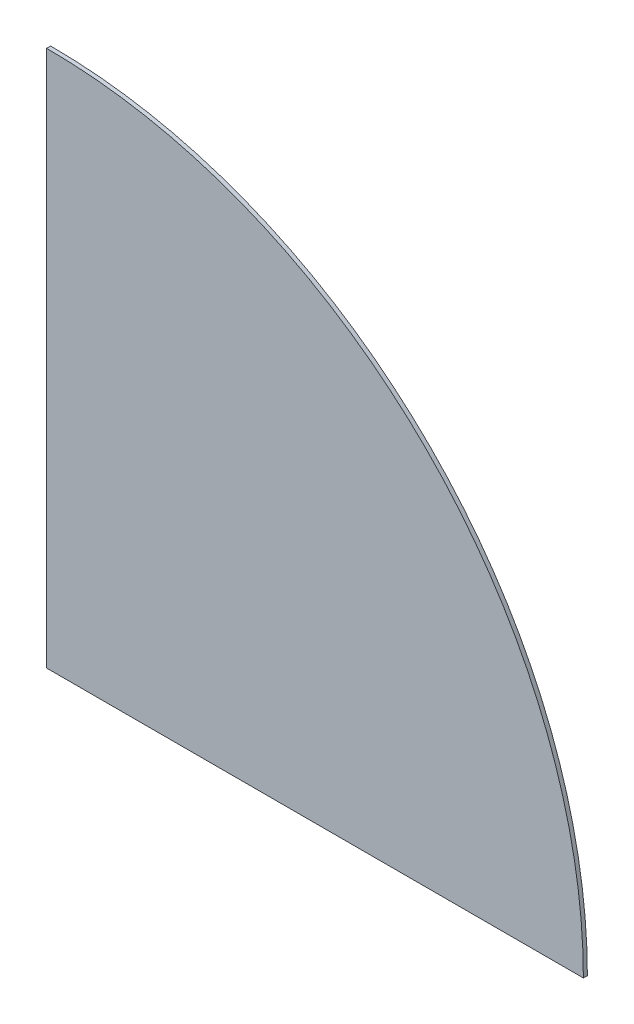
ISO-10303-21;
HEADER;
FILE_DESCRIPTION(('STEP AP214'),'2;1');
FILE_NAME('part.step','',(''),(''),'','','');
FILE_SCHEMA(('AUTOMOTIVE_DESIGN { 1 0 10303 214 1 1 1 1 }'));
ENDSEC;
DATA;
#1=APPLICATION_CONTEXT('core data for automotive mechanical design processes');
#2=APPLICATION_PROTOCOL_DEFINITION('international standard','automotive_design',2000,#1);
#3=PRODUCT_CONTEXT('',#1,'mechanical');
#4=PRODUCT('Part','Part','',(#3));
#5=PRODUCT_RELATED_PRODUCT_CATEGORY('part','',(#4));
#6=PRODUCT_DEFINITION_FORMATION('','',#4);
#7=PRODUCT_DEFINITION_CONTEXT('part definition',#1,'design');
#8=PRODUCT_DEFINITION('design','',#6,#7);
#9=PRODUCT_DEFINITION_SHAPE('','',#8);
#10=(LENGTH_UNIT() NAMED_UNIT(*) SI_UNIT(.MILLI.,.METRE.));
#11=(NAMED_UNIT(*) PLANE_ANGLE_UNIT() SI_UNIT($,.RADIAN.));
#12=(NAMED_UNIT(*) SI_UNIT($,.STERADIAN.) SOLID_ANGLE_UNIT());
#13=UNCERTAINTY_MEASURE_WITH_UNIT(LENGTH_MEASURE(1.E-05),#10,'distance_accuracy_value','');
#14=(GEOMETRIC_REPRESENTATION_CONTEXT(3) GLOBAL_UNCERTAINTY_ASSIGNED_CONTEXT((#13)) GLOBAL_UNIT_ASSIGNED_CONTEXT((#10,
#11,#12)) REPRESENTATION_CONTEXT('',''));
#15=CARTESIAN_POINT('',(0.,0.,0.));
#16=DIRECTION('',(0.,0.,1.));
#17=DIRECTION('',(1.,0.,0.));
#18=AXIS2_PLACEMENT_3D('',#15,#16,#17);
#19=CARTESIAN_POINT('',(-165.408360024912,-334.,1.));
#20=DIRECTION('',(-1.,0.,0.));
#21=DIRECTION('',(0.,0.,1.));
#22=AXIS2_PLACEMENT_3D('',#19,#20,#21);
#23=PLANE('',#22);
#24=DIRECTION('',(0.,1.,0.));
#25=VECTOR('',#24,1.);
#26=CARTESIAN_POINT('',(-165.408360024912,-334.,0.));
#27=LINE('',#26,#25);
#28=CARTESIAN_POINT('',(-165.408360024912,-334.,0.));
#29=VERTEX_POINT('',#28);
#30=CARTESIAN_POINT('',(-165.408360024912,-199.591639975088,0.));
#31=VERTEX_POINT('',#30);
#32=EDGE_CURVE('E86',#29,#31,#27,.T.);
#33=ORIENTED_EDGE('',*,*,#32,.F.);
#34=DIRECTION('',(0.,0.,-1.));
#35=VECTOR('',#34,1.);
#36=CARTESIAN_POINT('',(-165.408360024912,-334.,1.));
#37=LINE('',#36,#35);
#38=CARTESIAN_POINT('',(-165.408360024912,-334.,1.));
#39=VERTEX_POINT('',#38);
#40=EDGE_CURVE('E11',#39,#29,#37,.T.);
#41=ORIENTED_EDGE('',*,*,#40,.F.);
#42=DIRECTION('',(0.,1.,0.));
#43=VECTOR('',#42,1.);
#44=CARTESIAN_POINT('',(-165.408360024912,-334.,1.));
#45=LINE('',#44,#43);
#46=CARTESIAN_POINT('',(-165.408360024912,-199.591639975088,1.));
#47=VERTEX_POINT('',#46);
#48=EDGE_CURVE('E78',#39,#47,#45,.T.);
#49=ORIENTED_EDGE('',*,*,#48,.T.);
#50=DIRECTION('',(0.,0.,-1.));
#51=VECTOR('',#50,1.);
#52=CARTESIAN_POINT('',(-165.408360024912,-199.591639975088,1.));
#53=LINE('',#52,#51);
#54=EDGE_CURVE('E37',#47,#31,#53,.T.);
#55=ORIENTED_EDGE('',*,*,#54,.T.);
#56=EDGE_LOOP('',(#33,#41,#49,#55));
#57=FACE_BOUND('',#56,.T.);
#58=ADVANCED_FACE('F34',(#57),#23,.T.);
#59=CARTESIAN_POINT('',(-30.9999999999999,-334.,1.));
#60=DIRECTION('',(0.,-1.,0.));
#61=DIRECTION('',(0.,0.,-1.));
#62=AXIS2_PLACEMENT_3D('',#59,#60,#61);
#63=PLANE('',#62);
#64=DIRECTION('',(-1.,0.,0.));
#65=VECTOR('',#64,1.);
#66=CARTESIAN_POINT('',(-30.9999999999999,-334.,0.));
#67=LINE('',#66,#65);
#68=CARTESIAN_POINT('',(-30.9999999999999,-334.,0.));
#69=VERTEX_POINT('',#68);
#70=EDGE_CURVE('E80',#69,#29,#67,.T.);
#71=ORIENTED_EDGE('',*,*,#70,.F.);
#72=DIRECTION('',(0.,0.,-1.));
#73=VECTOR('',#72,1.);
#74=CARTESIAN_POINT('',(-30.9999999999999,-334.,1.));
#75=LINE('',#74,#73);
#76=CARTESIAN_POINT('',(-30.9999999999999,-334.,1.));
#77=VERTEX_POINT('',#76);
#78=EDGE_CURVE('E43',#77,#69,#75,.T.);
#79=ORIENTED_EDGE('',*,*,#78,.F.);
#80=DIRECTION('',(-1.,0.,0.));
#81=VECTOR('',#80,1.);
#82=CARTESIAN_POINT('',(-30.9999999999999,-334.,1.));
#83=LINE('',#82,#81);
#84=EDGE_CURVE('E75',#77,#39,#83,.T.);
#85=ORIENTED_EDGE('',*,*,#84,.T.);
#86=ORIENTED_EDGE('',*,*,#40,.T.);
#87=EDGE_LOOP('',(#71,#79,#85,#86));
#88=FACE_BOUND('',#87,.T.);
#89=ADVANCED_FACE('F90',(#88),#63,.T.);
#90=CARTESIAN_POINT('',(-165.408360024912,-334.,1.));
#91=DIRECTION('',(0.,0.,-1.));
#92=DIRECTION('',(-1.,0.,0.));
#93=AXIS2_PLACEMENT_3D('',#90,#91,#92);
#94=CYLINDRICAL_SURFACE('',#93,134.408360024912);
#95=CARTESIAN_POINT('',(-165.408360024912,-334.,0.));
#96=DIRECTION('',(0.,0.,-1.));
#97=DIRECTION('',(-1.,0.,0.));
#98=AXIS2_PLACEMENT_3D('',#95,#96,#97);
#99=CIRCLE('',#98,134.408360024912);
#100=EDGE_CURVE('E73',#31,#69,#99,.T.);
#101=ORIENTED_EDGE('',*,*,#100,.F.);
#102=ORIENTED_EDGE('',*,*,#54,.F.);
#103=CARTESIAN_POINT('',(-165.408360024912,-334.,1.));
#104=DIRECTION('',(0.,0.,-1.));
#105=DIRECTION('',(-1.,0.,0.));
#106=AXIS2_PLACEMENT_3D('',#103,#104,#105);
#107=CIRCLE('',#106,134.408360024912);
#108=EDGE_CURVE('E71',#47,#77,#107,.T.);
#109=ORIENTED_EDGE('',*,*,#108,.T.);
#110=ORIENTED_EDGE('',*,*,#78,.T.);
#111=EDGE_LOOP('',(#101,#102,#109,#110));
#112=FACE_BOUND('',#111,.T.);
#113=ADVANCED_FACE('F70',(#112),#94,.T.);
#114=CARTESIAN_POINT('',(-165.408360024912,-334.,1.));
#115=DIRECTION('',(0.,0.,-1.));
#116=DIRECTION('',(-1.,0.,0.));
#117=AXIS2_PLACEMENT_3D('',#114,#115,#116);
#118=PLANE('',#117);
#119=ORIENTED_EDGE('',*,*,#48,.F.);
#120=ORIENTED_EDGE('',*,*,#84,.F.);
#121=ORIENTED_EDGE('',*,*,#108,.F.);
#122=EDGE_LOOP('',(#119,#120,#121));
#123=FACE_BOUND('',#122,.T.);
#124=ADVANCED_FACE('F77',(#123),#118,.F.);
#125=CARTESIAN_POINT('',(-165.408360024912,-334.,0.));
#126=DIRECTION('',(0.,0.,-1.));
#127=DIRECTION('',(-1.,0.,0.));
#128=AXIS2_PLACEMENT_3D('',#125,#126,#127);
#129=PLANE('',#128);
#130=ORIENTED_EDGE('',*,*,#32,.T.);
#131=ORIENTED_EDGE('',*,*,#100,.T.);
#132=ORIENTED_EDGE('',*,*,#70,.T.);
#133=EDGE_LOOP('',(#130,#131,#132));
#134=FACE_BOUND('',#133,.T.);
#135=ADVANCED_FACE('F89',(#134),#129,.T.);
#136=CLOSED_SHELL('',(#58,#89,#113,#124,#135));
#137=MANIFOLD_SOLID_BREP('B2',#136);
#138=ADVANCED_BREP_SHAPE_REPRESENTATION('',(#18,#137),#14);
#139=SHAPE_DEFINITION_REPRESENTATION(#9,#138);
ENDSEC;
END-ISO-10303-21;
